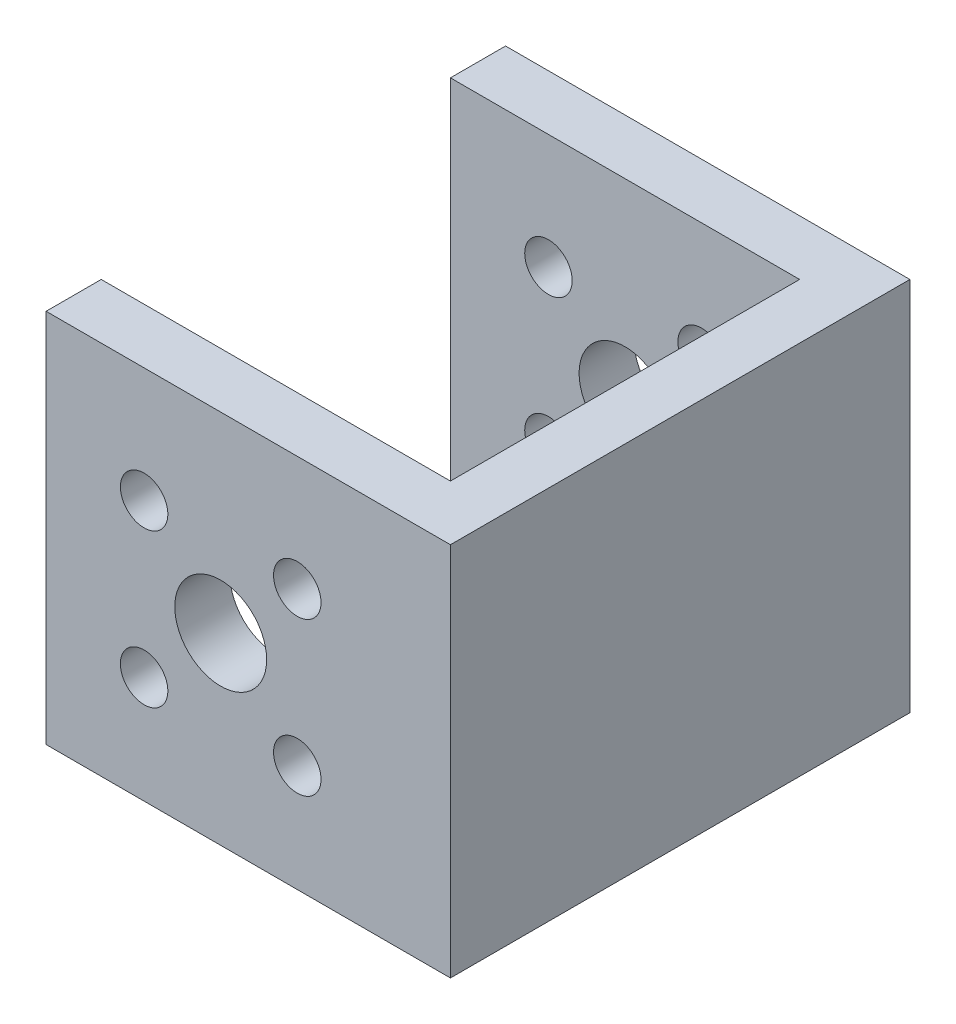
ISO-10303-21;
HEADER;
FILE_DESCRIPTION(('STEP AP214'),'2;1');
FILE_NAME('part.step','',(''),(''),'','','');
FILE_SCHEMA(('AUTOMOTIVE_DESIGN { 1 0 10303 214 1 1 1 1 }'));
ENDSEC;
DATA;
#1=APPLICATION_CONTEXT('core data for automotive mechanical design processes');
#2=APPLICATION_PROTOCOL_DEFINITION('international standard','automotive_design',2000,#1);
#3=PRODUCT_CONTEXT('',#1,'mechanical');
#4=PRODUCT('Part','Part','',(#3));
#5=PRODUCT_RELATED_PRODUCT_CATEGORY('part','',(#4));
#6=PRODUCT_DEFINITION_FORMATION('','',#4);
#7=PRODUCT_DEFINITION_CONTEXT('part definition',#1,'design');
#8=PRODUCT_DEFINITION('design','',#6,#7);
#9=PRODUCT_DEFINITION_SHAPE('','',#8);
#10=(LENGTH_UNIT() NAMED_UNIT(*) SI_UNIT(.MILLI.,.METRE.));
#11=(NAMED_UNIT(*) PLANE_ANGLE_UNIT() SI_UNIT($,.RADIAN.));
#12=(NAMED_UNIT(*) SI_UNIT($,.STERADIAN.) SOLID_ANGLE_UNIT());
#13=UNCERTAINTY_MEASURE_WITH_UNIT(LENGTH_MEASURE(1.E-05),#10,'distance_accuracy_value','');
#14=(GEOMETRIC_REPRESENTATION_CONTEXT(3) GLOBAL_UNCERTAINTY_ASSIGNED_CONTEXT((#13)) GLOBAL_UNIT_ASSIGNED_CONTEXT((#10,
#11,#12)) REPRESENTATION_CONTEXT('',''));
#15=CARTESIAN_POINT('',(0.,0.,0.));
#16=DIRECTION('',(0.,0.,1.));
#17=DIRECTION('',(1.,0.,0.));
#18=AXIS2_PLACEMENT_3D('',#15,#16,#17);
#19=CARTESIAN_POINT('',(0.,0.,30.));
#20=DIRECTION('',(0.,0.,-1.));
#21=DIRECTION('',(-1.,0.,0.));
#22=AXIS2_PLACEMENT_3D('',#19,#20,#21);
#23=CYLINDRICAL_SURFACE('',#22,3.);
#24=CARTESIAN_POINT('',(0.,0.,3.6));
#25=DIRECTION('',(0.,0.,-1.));
#26=DIRECTION('',(-1.,0.,0.));
#27=AXIS2_PLACEMENT_3D('',#24,#25,#26);
#28=CIRCLE('',#27,3.);
#29=CARTESIAN_POINT('',(-3.,0.,3.6));
#30=VERTEX_POINT('',#29);
#31=EDGE_CURVE('E274',#30,#30,#28,.T.);
#32=ORIENTED_EDGE('',*,*,#31,.F.);
#33=EDGE_LOOP('',(#32));
#34=FACE_BOUND('',#33,.T.);
#35=CARTESIAN_POINT('',(0.,0.,0.));
#36=DIRECTION('',(0.,0.,1.));
#37=DIRECTION('',(1.,0.,0.));
#38=AXIS2_PLACEMENT_3D('',#35,#36,#37);
#39=CIRCLE('',#38,3.);
#40=CARTESIAN_POINT('',(3.,0.,0.));
#41=VERTEX_POINT('',#40);
#42=EDGE_CURVE('E308',#41,#41,#39,.T.);
#43=ORIENTED_EDGE('',*,*,#42,.F.);
#44=EDGE_LOOP('',(#43));
#45=FACE_BOUND('',#44,.T.);
#46=ADVANCED_FACE('F133',(#34,#45),#23,.F.);
#47=CARTESIAN_POINT('',(-5.,5.,30.));
#48=DIRECTION('',(0.,0.,-1.));
#49=DIRECTION('',(-1.,0.,0.));
#50=AXIS2_PLACEMENT_3D('',#47,#48,#49);
#51=CYLINDRICAL_SURFACE('',#50,1.55);
#52=CARTESIAN_POINT('',(-5.,5.,3.6));
#53=DIRECTION('',(0.,0.,-1.));
#54=DIRECTION('',(-1.,0.,0.));
#55=AXIS2_PLACEMENT_3D('',#52,#53,#54);
#56=CIRCLE('',#55,1.55);
#57=CARTESIAN_POINT('',(-6.55,5.,3.6));
#58=VERTEX_POINT('',#57);
#59=EDGE_CURVE('E271',#58,#58,#56,.T.);
#60=ORIENTED_EDGE('',*,*,#59,.F.);
#61=EDGE_LOOP('',(#60));
#62=FACE_BOUND('',#61,.T.);
#63=CARTESIAN_POINT('',(-5.,5.,0.));
#64=DIRECTION('',(0.,0.,1.));
#65=DIRECTION('',(1.,0.,0.));
#66=AXIS2_PLACEMENT_3D('',#63,#64,#65);
#67=CIRCLE('',#66,1.55);
#68=CARTESIAN_POINT('',(-3.45,5.,0.));
#69=VERTEX_POINT('',#68);
#70=EDGE_CURVE('E305',#69,#69,#67,.T.);
#71=ORIENTED_EDGE('',*,*,#70,.F.);
#72=EDGE_LOOP('',(#71));
#73=FACE_BOUND('',#72,.T.);
#74=ADVANCED_FACE('F342',(#62,#73),#51,.F.);
#75=CARTESIAN_POINT('',(-5.,-5.,30.));
#76=DIRECTION('',(0.,0.,-1.));
#77=DIRECTION('',(-1.,0.,0.));
#78=AXIS2_PLACEMENT_3D('',#75,#76,#77);
#79=CYLINDRICAL_SURFACE('',#78,1.55);
#80=CARTESIAN_POINT('',(-5.,-5.,3.6));
#81=DIRECTION('',(0.,0.,-1.));
#82=DIRECTION('',(-1.,0.,0.));
#83=AXIS2_PLACEMENT_3D('',#80,#81,#82);
#84=CIRCLE('',#83,1.55);
#85=CARTESIAN_POINT('',(-6.55,-5.,3.6));
#86=VERTEX_POINT('',#85);
#87=EDGE_CURVE('E268',#86,#86,#84,.T.);
#88=ORIENTED_EDGE('',*,*,#87,.F.);
#89=EDGE_LOOP('',(#88));
#90=FACE_BOUND('',#89,.T.);
#91=CARTESIAN_POINT('',(-5.,-5.,0.));
#92=DIRECTION('',(0.,0.,1.));
#93=DIRECTION('',(1.,0.,0.));
#94=AXIS2_PLACEMENT_3D('',#91,#92,#93);
#95=CIRCLE('',#94,1.55);
#96=CARTESIAN_POINT('',(-3.45,-5.,0.));
#97=VERTEX_POINT('',#96);
#98=EDGE_CURVE('E302',#97,#97,#95,.T.);
#99=ORIENTED_EDGE('',*,*,#98,.F.);
#100=EDGE_LOOP('',(#99));
#101=FACE_BOUND('',#100,.T.);
#102=ADVANCED_FACE('F349',(#90,#101),#79,.F.);
#103=CARTESIAN_POINT('',(5.,-5.,30.));
#104=DIRECTION('',(0.,0.,-1.));
#105=DIRECTION('',(-1.,0.,0.));
#106=AXIS2_PLACEMENT_3D('',#103,#104,#105);
#107=CYLINDRICAL_SURFACE('',#106,1.55);
#108=CARTESIAN_POINT('',(5.,-5.,3.6));
#109=DIRECTION('',(0.,0.,-1.));
#110=DIRECTION('',(-1.,0.,0.));
#111=AXIS2_PLACEMENT_3D('',#108,#109,#110);
#112=CIRCLE('',#111,1.55);
#113=CARTESIAN_POINT('',(3.45,-5.,3.6));
#114=VERTEX_POINT('',#113);
#115=EDGE_CURVE('E265',#114,#114,#112,.T.);
#116=ORIENTED_EDGE('',*,*,#115,.F.);
#117=EDGE_LOOP('',(#116));
#118=FACE_BOUND('',#117,.T.);
#119=CARTESIAN_POINT('',(5.,-5.,0.));
#120=DIRECTION('',(0.,0.,1.));
#121=DIRECTION('',(1.,0.,0.));
#122=AXIS2_PLACEMENT_3D('',#119,#120,#121);
#123=CIRCLE('',#122,1.55);
#124=CARTESIAN_POINT('',(6.55,-5.,0.));
#125=VERTEX_POINT('',#124);
#126=EDGE_CURVE('E299',#125,#125,#123,.T.);
#127=ORIENTED_EDGE('',*,*,#126,.F.);
#128=EDGE_LOOP('',(#127));
#129=FACE_BOUND('',#128,.T.);
#130=ADVANCED_FACE('F326',(#118,#129),#107,.F.);
#131=CARTESIAN_POINT('',(5.,5.,30.));
#132=DIRECTION('',(0.,0.,-1.));
#133=DIRECTION('',(-1.,0.,0.));
#134=AXIS2_PLACEMENT_3D('',#131,#132,#133);
#135=CYLINDRICAL_SURFACE('',#134,1.55);
#136=CARTESIAN_POINT('',(5.,5.,3.6));
#137=DIRECTION('',(0.,0.,-1.));
#138=DIRECTION('',(-1.,0.,0.));
#139=AXIS2_PLACEMENT_3D('',#136,#137,#138);
#140=CIRCLE('',#139,1.55);
#141=CARTESIAN_POINT('',(3.45,5.,3.6));
#142=VERTEX_POINT('',#141);
#143=EDGE_CURVE('E264',#142,#142,#140,.T.);
#144=ORIENTED_EDGE('',*,*,#143,.F.);
#145=EDGE_LOOP('',(#144));
#146=FACE_BOUND('',#145,.T.);
#147=CARTESIAN_POINT('',(5.,5.,0.));
#148=DIRECTION('',(0.,0.,1.));
#149=DIRECTION('',(1.,0.,0.));
#150=AXIS2_PLACEMENT_3D('',#147,#148,#149);
#151=CIRCLE('',#150,1.55);
#152=CARTESIAN_POINT('',(6.55,5.,0.));
#153=VERTEX_POINT('',#152);
#154=EDGE_CURVE('E277',#153,#153,#151,.T.);
#155=ORIENTED_EDGE('',*,*,#154,.F.);
#156=EDGE_LOOP('',(#155));
#157=FACE_BOUND('',#156,.T.);
#158=ADVANCED_FACE('F322',(#146,#157),#135,.F.);
#159=CARTESIAN_POINT('',(0.,12.5,30.));
#160=DIRECTION('',(0.,1.,0.));
#161=DIRECTION('',(0.,0.,1.));
#162=AXIS2_PLACEMENT_3D('',#159,#160,#161);
#163=PLANE('',#162);
#164=DIRECTION('',(0.,0.,-1.));
#165=VECTOR('',#164,1.);
#166=CARTESIAN_POINT('',(-11.4,12.5,3.6));
#167=LINE('',#166,#165);
#168=CARTESIAN_POINT('',(-11.4,12.5,30.));
#169=VERTEX_POINT('',#168);
#170=CARTESIAN_POINT('',(-11.4,12.5,26.4));
#171=VERTEX_POINT('',#170);
#172=EDGE_CURVE('E216',#169,#171,#167,.T.);
#173=ORIENTED_EDGE('',*,*,#172,.F.);
#174=DIRECTION('',(1.,0.,0.));
#175=VECTOR('',#174,1.);
#176=CARTESIAN_POINT('',(0.,12.5,30.));
#177=LINE('',#176,#175);
#178=CARTESIAN_POINT('',(15.,12.5,30.));
#179=VERTEX_POINT('',#178);
#180=EDGE_CURVE('E148',#169,#179,#177,.T.);
#181=ORIENTED_EDGE('',*,*,#180,.T.);
#182=DIRECTION('',(0.,0.,-1.));
#183=VECTOR('',#182,1.);
#184=CARTESIAN_POINT('',(15.,12.5,30.));
#185=LINE('',#184,#183);
#186=CARTESIAN_POINT('',(15.,12.5,0.));
#187=VERTEX_POINT('',#186);
#188=EDGE_CURVE('E142',#179,#187,#185,.T.);
#189=ORIENTED_EDGE('',*,*,#188,.T.);
#190=DIRECTION('',(1.,0.,0.));
#191=VECTOR('',#190,1.);
#192=CARTESIAN_POINT('',(0.,12.5,0.));
#193=LINE('',#192,#191);
#194=CARTESIAN_POINT('',(-11.4,12.5,0.));
#195=VERTEX_POINT('',#194);
#196=EDGE_CURVE('E311',#195,#187,#193,.T.);
#197=ORIENTED_EDGE('',*,*,#196,.F.);
#198=CARTESIAN_POINT('',(-11.4,12.5,3.6));
#199=VERTEX_POINT('',#198);
#200=EDGE_CURVE('E201',#199,#195,#167,.T.);
#201=ORIENTED_EDGE('',*,*,#200,.F.);
#202=DIRECTION('',(-1.,0.,0.));
#203=VECTOR('',#202,1.);
#204=CARTESIAN_POINT('',(0.,12.5,3.6));
#205=LINE('',#204,#203);
#206=CARTESIAN_POINT('',(11.4,12.5,3.6));
#207=VERTEX_POINT('',#206);
#208=EDGE_CURVE('E239',#207,#199,#205,.T.);
#209=ORIENTED_EDGE('',*,*,#208,.F.);
#210=DIRECTION('',(0.,0.,-1.));
#211=VECTOR('',#210,1.);
#212=CARTESIAN_POINT('',(11.4,12.5,3.6));
#213=LINE('',#212,#211);
#214=CARTESIAN_POINT('',(11.4,12.5,26.4));
#215=VERTEX_POINT('',#214);
#216=EDGE_CURVE('E236',#215,#207,#213,.T.);
#217=ORIENTED_EDGE('',*,*,#216,.F.);
#218=DIRECTION('',(1.,0.,0.));
#219=VECTOR('',#218,1.);
#220=CARTESIAN_POINT('',(11.4,12.5,26.4));
#221=LINE('',#220,#219);
#222=EDGE_CURVE('E233',#171,#215,#221,.T.);
#223=ORIENTED_EDGE('',*,*,#222,.F.);
#224=EDGE_LOOP('',(#173,#181,#189,#197,#201,#209,#217,#223));
#225=FACE_BOUND('',#224,.T.);
#226=ADVANCED_FACE('F325',(#225),#163,.T.);
#227=CARTESIAN_POINT('',(0.,0.,26.4));
#228=DIRECTION('',(0.,0.,1.));
#229=DIRECTION('',(1.,0.,0.));
#230=AXIS2_PLACEMENT_3D('',#227,#228,#229);
#231=CIRCLE('',#230,3.);
#232=CARTESIAN_POINT('',(3.,0.,26.4));
#233=VERTEX_POINT('',#232);
#234=EDGE_CURVE('E261',#233,#233,#231,.T.);
#235=ORIENTED_EDGE('',*,*,#234,.F.);
#236=EDGE_LOOP('',(#235));
#237=FACE_BOUND('',#236,.T.);
#238=CARTESIAN_POINT('',(0.,0.,30.));
#239=DIRECTION('',(0.,0.,1.));
#240=DIRECTION('',(1.,0.,0.));
#241=AXIS2_PLACEMENT_3D('',#238,#239,#240);
#242=CIRCLE('',#241,3.);
#243=CARTESIAN_POINT('',(3.,0.,30.));
#244=VERTEX_POINT('',#243);
#245=EDGE_CURVE('E290',#244,#244,#242,.T.);
#246=ORIENTED_EDGE('',*,*,#245,.T.);
#247=EDGE_LOOP('',(#246));
#248=FACE_BOUND('',#247,.T.);
#249=ADVANCED_FACE('F345',(#237,#248),#23,.F.);
#250=CARTESIAN_POINT('',(-5.,5.,26.4));
#251=DIRECTION('',(0.,0.,1.));
#252=DIRECTION('',(1.,0.,0.));
#253=AXIS2_PLACEMENT_3D('',#250,#251,#252);
#254=CIRCLE('',#253,1.55);
#255=CARTESIAN_POINT('',(-3.45,5.,26.4));
#256=VERTEX_POINT('',#255);
#257=EDGE_CURVE('E258',#256,#256,#254,.T.);
#258=ORIENTED_EDGE('',*,*,#257,.F.);
#259=EDGE_LOOP('',(#258));
#260=FACE_BOUND('',#259,.T.);
#261=CARTESIAN_POINT('',(-5.,5.,30.));
#262=DIRECTION('',(0.,0.,1.));
#263=DIRECTION('',(1.,0.,0.));
#264=AXIS2_PLACEMENT_3D('',#261,#262,#263);
#265=CIRCLE('',#264,1.55);
#266=CARTESIAN_POINT('',(-3.45,5.,30.));
#267=VERTEX_POINT('',#266);
#268=EDGE_CURVE('E287',#267,#267,#265,.T.);
#269=ORIENTED_EDGE('',*,*,#268,.T.);
#270=EDGE_LOOP('',(#269));
#271=FACE_BOUND('',#270,.T.);
#272=ADVANCED_FACE('F352',(#260,#271),#51,.F.);
#273=CARTESIAN_POINT('',(-5.,-5.,26.4));
#274=DIRECTION('',(0.,0.,1.));
#275=DIRECTION('',(1.,0.,0.));
#276=AXIS2_PLACEMENT_3D('',#273,#274,#275);
#277=CIRCLE('',#276,1.55);
#278=CARTESIAN_POINT('',(-3.45,-5.,26.4));
#279=VERTEX_POINT('',#278);
#280=EDGE_CURVE('E255',#279,#279,#277,.T.);
#281=ORIENTED_EDGE('',*,*,#280,.F.);
#282=EDGE_LOOP('',(#281));
#283=FACE_BOUND('',#282,.T.);
#284=CARTESIAN_POINT('',(-5.,-5.,30.));
#285=DIRECTION('',(0.,0.,1.));
#286=DIRECTION('',(1.,0.,0.));
#287=AXIS2_PLACEMENT_3D('',#284,#285,#286);
#288=CIRCLE('',#287,1.55);
#289=CARTESIAN_POINT('',(-3.45,-5.,30.));
#290=VERTEX_POINT('',#289);
#291=EDGE_CURVE('E284',#290,#290,#288,.T.);
#292=ORIENTED_EDGE('',*,*,#291,.T.);
#293=EDGE_LOOP('',(#292));
#294=FACE_BOUND('',#293,.T.);
#295=ADVANCED_FACE('F361',(#283,#294),#79,.F.);
#296=CARTESIAN_POINT('',(5.,-5.,26.4));
#297=DIRECTION('',(0.,0.,1.));
#298=DIRECTION('',(1.,0.,0.));
#299=AXIS2_PLACEMENT_3D('',#296,#297,#298);
#300=CIRCLE('',#299,1.55);
#301=CARTESIAN_POINT('',(6.55,-5.,26.4));
#302=VERTEX_POINT('',#301);
#303=EDGE_CURVE('E252',#302,#302,#300,.T.);
#304=ORIENTED_EDGE('',*,*,#303,.F.);
#305=EDGE_LOOP('',(#304));
#306=FACE_BOUND('',#305,.T.);
#307=CARTESIAN_POINT('',(5.,-5.,30.));
#308=DIRECTION('',(0.,0.,1.));
#309=DIRECTION('',(1.,0.,0.));
#310=AXIS2_PLACEMENT_3D('',#307,#308,#309);
#311=CIRCLE('',#310,1.55);
#312=CARTESIAN_POINT('',(6.55,-5.,30.));
#313=VERTEX_POINT('',#312);
#314=EDGE_CURVE('E281',#313,#313,#311,.T.);
#315=ORIENTED_EDGE('',*,*,#314,.T.);
#316=EDGE_LOOP('',(#315));
#317=FACE_BOUND('',#316,.T.);
#318=ADVANCED_FACE('F459',(#306,#317),#107,.F.);
#319=CARTESIAN_POINT('',(5.,5.,26.4));
#320=DIRECTION('',(0.,0.,1.));
#321=DIRECTION('',(1.,0.,0.));
#322=AXIS2_PLACEMENT_3D('',#319,#320,#321);
#323=CIRCLE('',#322,1.55);
#324=CARTESIAN_POINT('',(6.55,5.,26.4));
#325=VERTEX_POINT('',#324);
#326=EDGE_CURVE('E245',#325,#325,#323,.T.);
#327=ORIENTED_EDGE('',*,*,#326,.F.);
#328=EDGE_LOOP('',(#327));
#329=FACE_BOUND('',#328,.T.);
#330=CARTESIAN_POINT('',(5.,5.,30.));
#331=DIRECTION('',(0.,0.,1.));
#332=DIRECTION('',(1.,0.,0.));
#333=AXIS2_PLACEMENT_3D('',#330,#331,#332);
#334=CIRCLE('',#333,1.55);
#335=CARTESIAN_POINT('',(6.55,5.,30.));
#336=VERTEX_POINT('',#335);
#337=EDGE_CURVE('E278',#336,#336,#334,.T.);
#338=ORIENTED_EDGE('',*,*,#337,.T.);
#339=EDGE_LOOP('',(#338));
#340=FACE_BOUND('',#339,.T.);
#341=ADVANCED_FACE('F135',(#329,#340),#135,.F.);
#342=CARTESIAN_POINT('',(15.,0.,30.));
#343=DIRECTION('',(1.,0.,0.));
#344=DIRECTION('',(0.,1.,0.));
#345=AXIS2_PLACEMENT_3D('',#342,#343,#344);
#346=PLANE('',#345);
#347=DIRECTION('',(0.,0.,1.));
#348=VECTOR('',#347,1.);
#349=CARTESIAN_POINT('',(15.,-12.,30.));
#350=LINE('',#349,#348);
#351=CARTESIAN_POINT('',(15.,-12.,0.));
#352=VERTEX_POINT('',#351);
#353=CARTESIAN_POINT('',(15.,-12.,30.));
#354=VERTEX_POINT('',#353);
#355=EDGE_CURVE('E222',#352,#354,#350,.T.);
#356=ORIENTED_EDGE('',*,*,#355,.F.);
#357=DIRECTION('',(0.,-1.,0.));
#358=VECTOR('',#357,1.);
#359=CARTESIAN_POINT('',(15.,0.,0.));
#360=LINE('',#359,#358);
#361=EDGE_CURVE('E221',#187,#352,#360,.T.);
#362=ORIENTED_EDGE('',*,*,#361,.F.);
#363=ORIENTED_EDGE('',*,*,#188,.F.);
#364=DIRECTION('',(0.,-1.,0.));
#365=VECTOR('',#364,1.);
#366=CARTESIAN_POINT('',(15.,0.,30.));
#367=LINE('',#366,#365);
#368=EDGE_CURVE('E294',#179,#354,#367,.T.);
#369=ORIENTED_EDGE('',*,*,#368,.T.);
#370=EDGE_LOOP('',(#356,#362,#363,#369));
#371=FACE_BOUND('',#370,.T.);
#372=ADVANCED_FACE('F369',(#371),#346,.T.);
#373=CARTESIAN_POINT('',(0.,0.,30.));
#374=DIRECTION('',(0.,0.,1.));
#375=DIRECTION('',(1.,0.,0.));
#376=AXIS2_PLACEMENT_3D('',#373,#374,#375);
#377=PLANE('',#376);
#378=DIRECTION('',(0.,1.,0.));
#379=VECTOR('',#378,1.);
#380=CARTESIAN_POINT('',(-11.4,-12.,30.));
#381=LINE('',#380,#379);
#382=CARTESIAN_POINT('',(-11.4,-12.,30.));
#383=VERTEX_POINT('',#382);
#384=EDGE_CURVE('E206',#383,#169,#381,.T.);
#385=ORIENTED_EDGE('',*,*,#384,.F.);
#386=DIRECTION('',(-1.,0.,0.));
#387=VECTOR('',#386,1.);
#388=CARTESIAN_POINT('',(-15.,-12.,30.));
#389=LINE('',#388,#387);
#390=EDGE_CURVE('E224',#354,#383,#389,.T.);
#391=ORIENTED_EDGE('',*,*,#390,.F.);
#392=ORIENTED_EDGE('',*,*,#368,.F.);
#393=ORIENTED_EDGE('',*,*,#180,.F.);
#394=EDGE_LOOP('',(#385,#391,#392,#393));
#395=FACE_BOUND('',#394,.T.);
#396=ORIENTED_EDGE('',*,*,#337,.F.);
#397=EDGE_LOOP('',(#396));
#398=FACE_BOUND('',#397,.T.);
#399=ORIENTED_EDGE('',*,*,#314,.F.);
#400=EDGE_LOOP('',(#399));
#401=FACE_BOUND('',#400,.T.);
#402=ORIENTED_EDGE('',*,*,#291,.F.);
#403=EDGE_LOOP('',(#402));
#404=FACE_BOUND('',#403,.T.);
#405=ORIENTED_EDGE('',*,*,#268,.F.);
#406=EDGE_LOOP('',(#405));
#407=FACE_BOUND('',#406,.T.);
#408=ORIENTED_EDGE('',*,*,#245,.F.);
#409=EDGE_LOOP('',(#408));
#410=FACE_BOUND('',#409,.T.);
#411=ADVANCED_FACE('F331',(#395,#398,#401,#404,#407,#410),#377,.T.);
#412=CARTESIAN_POINT('',(0.,0.,0.));
#413=DIRECTION('',(0.,0.,1.));
#414=DIRECTION('',(1.,0.,0.));
#415=AXIS2_PLACEMENT_3D('',#412,#413,#414);
#416=PLANE('',#415);
#417=ORIENTED_EDGE('',*,*,#154,.T.);
#418=EDGE_LOOP('',(#417));
#419=FACE_BOUND('',#418,.T.);
#420=ORIENTED_EDGE('',*,*,#126,.T.);
#421=EDGE_LOOP('',(#420));
#422=FACE_BOUND('',#421,.T.);
#423=ORIENTED_EDGE('',*,*,#98,.T.);
#424=EDGE_LOOP('',(#423));
#425=FACE_BOUND('',#424,.T.);
#426=ORIENTED_EDGE('',*,*,#70,.T.);
#427=EDGE_LOOP('',(#426));
#428=FACE_BOUND('',#427,.T.);
#429=ORIENTED_EDGE('',*,*,#42,.T.);
#430=EDGE_LOOP('',(#429));
#431=FACE_BOUND('',#430,.T.);
#432=DIRECTION('',(1.,0.,0.));
#433=VECTOR('',#432,1.);
#434=CARTESIAN_POINT('',(15.,-12.,0.));
#435=LINE('',#434,#433);
#436=CARTESIAN_POINT('',(-11.4,-12.,0.));
#437=VERTEX_POINT('',#436);
#438=EDGE_CURVE('E205',#437,#352,#435,.T.);
#439=ORIENTED_EDGE('',*,*,#438,.F.);
#440=DIRECTION('',(0.,1.,0.));
#441=VECTOR('',#440,1.);
#442=CARTESIAN_POINT('',(-11.4,-12.,0.));
#443=LINE('',#442,#441);
#444=EDGE_CURVE('E195',#437,#195,#443,.T.);
#445=ORIENTED_EDGE('',*,*,#444,.T.);
#446=ORIENTED_EDGE('',*,*,#196,.T.);
#447=ORIENTED_EDGE('',*,*,#361,.T.);
#448=EDGE_LOOP('',(#439,#445,#446,#447));
#449=FACE_BOUND('',#448,.T.);
#450=ADVANCED_FACE('F219',(#419,#422,#425,#428,#431,#449),#416,.F.);
#451=CARTESIAN_POINT('',(0.,-24.,3.6));
#452=DIRECTION('',(0.,0.,-1.));
#453=DIRECTION('',(-1.,0.,0.));
#454=AXIS2_PLACEMENT_3D('',#451,#452,#453);
#455=PLANE('',#454);
#456=ORIENTED_EDGE('',*,*,#31,.T.);
#457=EDGE_LOOP('',(#456));
#458=FACE_BOUND('',#457,.T.);
#459=ORIENTED_EDGE('',*,*,#59,.T.);
#460=EDGE_LOOP('',(#459));
#461=FACE_BOUND('',#460,.T.);
#462=ORIENTED_EDGE('',*,*,#87,.T.);
#463=EDGE_LOOP('',(#462));
#464=FACE_BOUND('',#463,.T.);
#465=ORIENTED_EDGE('',*,*,#115,.T.);
#466=EDGE_LOOP('',(#465));
#467=FACE_BOUND('',#466,.T.);
#468=ORIENTED_EDGE('',*,*,#143,.T.);
#469=EDGE_LOOP('',(#468));
#470=FACE_BOUND('',#469,.T.);
#471=DIRECTION('',(0.,1.,0.));
#472=VECTOR('',#471,1.);
#473=CARTESIAN_POINT('',(-11.4,-24.,3.6));
#474=LINE('',#473,#472);
#475=CARTESIAN_POINT('',(-11.4,-12.,3.6));
#476=VERTEX_POINT('',#475);
#477=EDGE_CURVE('E243',#476,#199,#474,.T.);
#478=ORIENTED_EDGE('',*,*,#477,.F.);
#479=DIRECTION('',(1.,0.,0.));
#480=VECTOR('',#479,1.);
#481=CARTESIAN_POINT('',(0.,-12.,3.6));
#482=LINE('',#481,#480);
#483=CARTESIAN_POINT('',(11.4,-12.,3.6));
#484=VERTEX_POINT('',#483);
#485=EDGE_CURVE('E213',#476,#484,#482,.T.);
#486=ORIENTED_EDGE('',*,*,#485,.T.);
#487=DIRECTION('',(0.,1.,0.));
#488=VECTOR('',#487,1.);
#489=CARTESIAN_POINT('',(11.4,-24.,3.6));
#490=LINE('',#489,#488);
#491=EDGE_CURVE('E246',#484,#207,#490,.T.);
#492=ORIENTED_EDGE('',*,*,#491,.T.);
#493=ORIENTED_EDGE('',*,*,#208,.T.);
#494=EDGE_LOOP('',(#478,#486,#492,#493));
#495=FACE_BOUND('',#494,.T.);
#496=ADVANCED_FACE('F319',(#458,#461,#464,#467,#470,#495),#455,.F.);
#497=CARTESIAN_POINT('',(11.4,-24.,3.6));
#498=DIRECTION('',(1.,0.,0.));
#499=DIRECTION('',(0.,0.,-1.));
#500=AXIS2_PLACEMENT_3D('',#497,#498,#499);
#501=PLANE('',#500);
#502=ORIENTED_EDGE('',*,*,#491,.F.);
#503=DIRECTION('',(0.,0.,1.));
#504=VECTOR('',#503,1.);
#505=CARTESIAN_POINT('',(11.4,-12.,3.6));
#506=LINE('',#505,#504);
#507=CARTESIAN_POINT('',(11.4,-12.,26.4));
#508=VERTEX_POINT('',#507);
#509=EDGE_CURVE('E229',#484,#508,#506,.T.);
#510=ORIENTED_EDGE('',*,*,#509,.T.);
#511=DIRECTION('',(0.,1.,0.));
#512=VECTOR('',#511,1.);
#513=CARTESIAN_POINT('',(11.4,-24.,26.4));
#514=LINE('',#513,#512);
#515=EDGE_CURVE('E248',#508,#215,#514,.T.);
#516=ORIENTED_EDGE('',*,*,#515,.T.);
#517=ORIENTED_EDGE('',*,*,#216,.T.);
#518=EDGE_LOOP('',(#502,#510,#516,#517));
#519=FACE_BOUND('',#518,.T.);
#520=ADVANCED_FACE('F383',(#519),#501,.F.);
#521=CARTESIAN_POINT('',(11.4,-24.,26.4));
#522=DIRECTION('',(0.,0.,1.));
#523=DIRECTION('',(1.,0.,0.));
#524=AXIS2_PLACEMENT_3D('',#521,#522,#523);
#525=PLANE('',#524);
#526=ORIENTED_EDGE('',*,*,#234,.T.);
#527=EDGE_LOOP('',(#526));
#528=FACE_BOUND('',#527,.T.);
#529=ORIENTED_EDGE('',*,*,#257,.T.);
#530=EDGE_LOOP('',(#529));
#531=FACE_BOUND('',#530,.T.);
#532=ORIENTED_EDGE('',*,*,#280,.T.);
#533=EDGE_LOOP('',(#532));
#534=FACE_BOUND('',#533,.T.);
#535=ORIENTED_EDGE('',*,*,#303,.T.);
#536=EDGE_LOOP('',(#535));
#537=FACE_BOUND('',#536,.T.);
#538=ORIENTED_EDGE('',*,*,#326,.T.);
#539=EDGE_LOOP('',(#538));
#540=FACE_BOUND('',#539,.T.);
#541=ORIENTED_EDGE('',*,*,#515,.F.);
#542=DIRECTION('',(-1.,0.,0.));
#543=VECTOR('',#542,1.);
#544=CARTESIAN_POINT('',(11.4,-12.,26.4));
#545=LINE('',#544,#543);
#546=CARTESIAN_POINT('',(-11.4,-12.,26.4));
#547=VERTEX_POINT('',#546);
#548=EDGE_CURVE('E12',#508,#547,#545,.T.);
#549=ORIENTED_EDGE('',*,*,#548,.T.);
#550=DIRECTION('',(0.,1.,0.));
#551=VECTOR('',#550,1.);
#552=CARTESIAN_POINT('',(-11.4,-24.,26.4));
#553=LINE('',#552,#551);
#554=EDGE_CURVE('E242',#547,#171,#553,.T.);
#555=ORIENTED_EDGE('',*,*,#554,.T.);
#556=ORIENTED_EDGE('',*,*,#222,.T.);
#557=EDGE_LOOP('',(#541,#549,#555,#556));
#558=FACE_BOUND('',#557,.T.);
#559=ADVANCED_FACE('F380',(#528,#531,#534,#537,#540,#558),#525,.F.);
#560=CARTESIAN_POINT('',(0.,-12.,0.));
#561=DIRECTION('',(0.,1.,0.));
#562=DIRECTION('',(-1.,0.,0.));
#563=AXIS2_PLACEMENT_3D('',#560,#561,#562);
#564=PLANE('',#563);
#565=ORIENTED_EDGE('',*,*,#390,.T.);
#566=DIRECTION('',(0.,0.,-1.));
#567=VECTOR('',#566,1.);
#568=CARTESIAN_POINT('',(-11.4,-12.,30.));
#569=LINE('',#568,#567);
#570=EDGE_CURVE('E215',#383,#547,#569,.T.);
#571=ORIENTED_EDGE('',*,*,#570,.T.);
#572=ORIENTED_EDGE('',*,*,#548,.F.);
#573=ORIENTED_EDGE('',*,*,#509,.F.);
#574=ORIENTED_EDGE('',*,*,#485,.F.);
#575=EDGE_CURVE('E198',#476,#437,#569,.T.);
#576=ORIENTED_EDGE('',*,*,#575,.T.);
#577=ORIENTED_EDGE('',*,*,#438,.T.);
#578=ORIENTED_EDGE('',*,*,#355,.T.);
#579=EDGE_LOOP('',(#565,#571,#572,#573,#574,#576,#577,#578));
#580=FACE_BOUND('',#579,.T.);
#581=ADVANCED_FACE('F210',(#580),#564,.F.);
#582=CARTESIAN_POINT('',(-11.4,-12.,3.6));
#583=DIRECTION('',(1.,0.,0.));
#584=DIRECTION('',(0.,0.,-1.));
#585=AXIS2_PLACEMENT_3D('',#582,#583,#584);
#586=PLANE('',#585);
#587=ORIENTED_EDGE('',*,*,#570,.F.);
#588=ORIENTED_EDGE('',*,*,#384,.T.);
#589=ORIENTED_EDGE('',*,*,#172,.T.);
#590=ORIENTED_EDGE('',*,*,#554,.F.);
#591=EDGE_LOOP('',(#587,#588,#589,#590));
#592=FACE_BOUND('',#591,.T.);
#593=ADVANCED_FACE('F393',(#592),#586,.F.);
#594=ORIENTED_EDGE('',*,*,#200,.T.);
#595=ORIENTED_EDGE('',*,*,#444,.F.);
#596=ORIENTED_EDGE('',*,*,#575,.F.);
#597=ORIENTED_EDGE('',*,*,#477,.T.);
#598=EDGE_LOOP('',(#594,#595,#596,#597));
#599=FACE_BOUND('',#598,.T.);
#600=ADVANCED_FACE('F197',(#599),#586,.F.);
#601=CLOSED_SHELL('',(#46,#74,#102,#130,#158,#226,#249,#272,#295,#318,#341,#372,#411,#450,#496,
#520,#559,#581,#593,#600));
#602=MANIFOLD_SOLID_BREP('B2',#601);
#603=ADVANCED_BREP_SHAPE_REPRESENTATION('',(#18,#602),#14);
#604=SHAPE_DEFINITION_REPRESENTATION(#9,#603);
ENDSEC;
END-ISO-10303-21;
